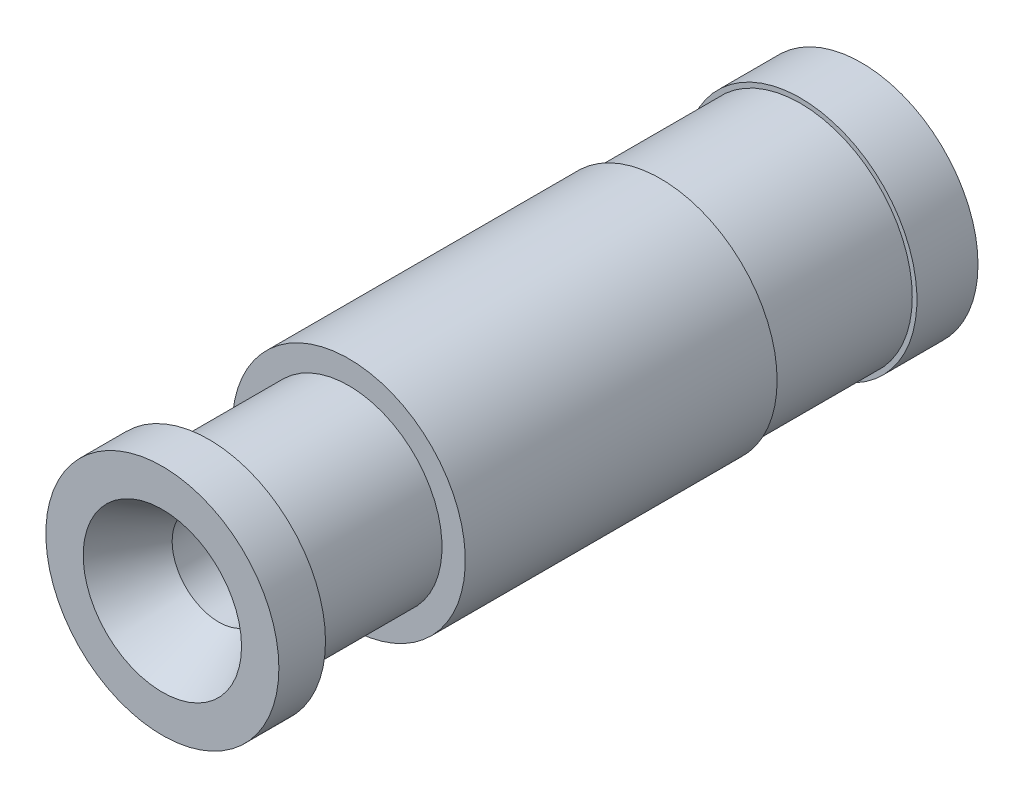
ISO-10303-21;
HEADER;
FILE_DESCRIPTION(('STEP AP214'),'2;1');
FILE_NAME('part.step','',(''),(''),'','','');
FILE_SCHEMA(('AUTOMOTIVE_DESIGN { 1 0 10303 214 1 1 1 1 }'));
ENDSEC;
DATA;
#1=APPLICATION_CONTEXT('core data for automotive mechanical design processes');
#2=APPLICATION_PROTOCOL_DEFINITION('international standard','automotive_design',2000,#1);
#3=PRODUCT_CONTEXT('',#1,'mechanical');
#4=PRODUCT('Part','Part','',(#3));
#5=PRODUCT_RELATED_PRODUCT_CATEGORY('part','',(#4));
#6=PRODUCT_DEFINITION_FORMATION('','',#4);
#7=PRODUCT_DEFINITION_CONTEXT('part definition',#1,'design');
#8=PRODUCT_DEFINITION('design','',#6,#7);
#9=PRODUCT_DEFINITION_SHAPE('','',#8);
#10=(LENGTH_UNIT() NAMED_UNIT(*) SI_UNIT(.MILLI.,.METRE.));
#11=(NAMED_UNIT(*) PLANE_ANGLE_UNIT() SI_UNIT($,.RADIAN.));
#12=(NAMED_UNIT(*) SI_UNIT($,.STERADIAN.) SOLID_ANGLE_UNIT());
#13=UNCERTAINTY_MEASURE_WITH_UNIT(LENGTH_MEASURE(1.E-05),#10,'distance_accuracy_value','');
#14=(GEOMETRIC_REPRESENTATION_CONTEXT(3) GLOBAL_UNCERTAINTY_ASSIGNED_CONTEXT((#13)) GLOBAL_UNIT_ASSIGNED_CONTEXT((#10,
#11,#12)) REPRESENTATION_CONTEXT('',''));
#15=CARTESIAN_POINT('',(0.,0.,0.));
#16=DIRECTION('',(0.,0.,1.));
#17=DIRECTION('',(1.,0.,0.));
#18=AXIS2_PLACEMENT_3D('',#15,#16,#17);
#19=CARTESIAN_POINT('',(0.,0.,15.));
#20=DIRECTION('',(0.,0.,-1.));
#21=DIRECTION('',(-1.,0.,0.));
#22=AXIS2_PLACEMENT_3D('',#19,#20,#21);
#23=CYLINDRICAL_SURFACE('',#22,2.5);
#24=CARTESIAN_POINT('',(0.,0.,4.31010946820187));
#25=DIRECTION('',(0.,0.,1.));
#26=DIRECTION('',(1.,0.,0.));
#27=AXIS2_PLACEMENT_3D('',#24,#25,#26);
#28=CIRCLE('',#27,2.5);
#29=CARTESIAN_POINT('',(2.5,0.,4.31010946820187));
#30=VERTEX_POINT('',#29);
#31=EDGE_CURVE('E57',#30,#30,#28,.T.);
#32=ORIENTED_EDGE('',*,*,#31,.T.);
#33=EDGE_LOOP('',(#32));
#34=FACE_BOUND('',#33,.T.);
#35=CARTESIAN_POINT('',(0.,0.,11.));
#36=DIRECTION('',(0.,0.,-1.));
#37=DIRECTION('',(-1.,0.,0.));
#38=AXIS2_PLACEMENT_3D('',#35,#36,#37);
#39=CIRCLE('',#38,2.5);
#40=CARTESIAN_POINT('',(-2.5,0.,11.));
#41=VERTEX_POINT('',#40);
#42=EDGE_CURVE('E69',#41,#41,#39,.T.);
#43=ORIENTED_EDGE('',*,*,#42,.T.);
#44=EDGE_LOOP('',(#43));
#45=FACE_BOUND('',#44,.T.);
#46=ADVANCED_FACE('F36',(#34,#45),#23,.T.);
#47=CARTESIAN_POINT('',(0.,0.,14.));
#48=DIRECTION('',(0.,0.,1.));
#49=DIRECTION('',(1.,0.,0.));
#50=AXIS2_PLACEMENT_3D('',#47,#48,#49);
#51=CIRCLE('',#50,2.5);
#52=CARTESIAN_POINT('',(2.5,0.,14.));
#53=VERTEX_POINT('',#52);
#54=EDGE_CURVE('E65',#53,#53,#51,.T.);
#55=ORIENTED_EDGE('',*,*,#54,.T.);
#56=EDGE_LOOP('',(#55));
#57=FACE_BOUND('',#56,.T.);
#58=CARTESIAN_POINT('',(0.,0.,15.));
#59=DIRECTION('',(0.,0.,1.));
#60=DIRECTION('',(1.,0.,0.));
#61=AXIS2_PLACEMENT_3D('',#58,#59,#60);
#62=CIRCLE('',#61,2.5);
#63=CARTESIAN_POINT('',(2.5,0.,15.));
#64=VERTEX_POINT('',#63);
#65=EDGE_CURVE('E56',#64,#64,#62,.T.);
#66=ORIENTED_EDGE('',*,*,#65,.F.);
#67=EDGE_LOOP('',(#66));
#68=FACE_BOUND('',#67,.T.);
#69=ADVANCED_FACE('F112',(#57,#68),#23,.T.);
#70=CARTESIAN_POINT('',(0.,0.,1.31010946820187));
#71=DIRECTION('',(0.,0.,-1.));
#72=DIRECTION('',(-1.,0.,0.));
#73=AXIS2_PLACEMENT_3D('',#70,#71,#72);
#74=CIRCLE('',#73,2.5);
#75=CARTESIAN_POINT('',(-2.5,0.,1.31010946820187));
#76=VERTEX_POINT('',#75);
#77=EDGE_CURVE('E61',#76,#76,#74,.T.);
#78=ORIENTED_EDGE('',*,*,#77,.T.);
#79=EDGE_LOOP('',(#78));
#80=FACE_BOUND('',#79,.T.);
#81=CARTESIAN_POINT('',(0.,0.,0.));
#82=DIRECTION('',(0.,0.,1.));
#83=DIRECTION('',(1.,0.,0.));
#84=AXIS2_PLACEMENT_3D('',#81,#82,#83);
#85=CIRCLE('',#84,2.5);
#86=CARTESIAN_POINT('',(2.5,0.,0.));
#87=VERTEX_POINT('',#86);
#88=EDGE_CURVE('E76',#87,#87,#85,.T.);
#89=ORIENTED_EDGE('',*,*,#88,.T.);
#90=EDGE_LOOP('',(#89));
#91=FACE_BOUND('',#90,.T.);
#92=ADVANCED_FACE('F114',(#80,#91),#23,.T.);
#93=CARTESIAN_POINT('',(0.,0.,15.));
#94=DIRECTION('',(0.,0.,1.));
#95=DIRECTION('',(1.,0.,0.));
#96=AXIS2_PLACEMENT_3D('',#93,#94,#95);
#97=PLANE('',#96);
#98=CARTESIAN_POINT('',(0.,0.,15.));
#99=DIRECTION('',(0.,0.,1.));
#100=DIRECTION('',(1.,0.,0.));
#101=AXIS2_PLACEMENT_3D('',#98,#99,#100);
#102=CIRCLE('',#101,1.69859382571945);
#103=CARTESIAN_POINT('',(1.69859382571945,0.,15.));
#104=VERTEX_POINT('',#103);
#105=EDGE_CURVE('E43',#104,#104,#102,.F.);
#106=ORIENTED_EDGE('',*,*,#105,.T.);
#107=EDGE_LOOP('',(#106));
#108=FACE_BOUND('',#107,.T.);
#109=ORIENTED_EDGE('',*,*,#65,.T.);
#110=EDGE_LOOP('',(#109));
#111=FACE_BOUND('',#110,.T.);
#112=ADVANCED_FACE('F143',(#108,#111),#97,.T.);
#113=CARTESIAN_POINT('',(0.,0.,0.));
#114=DIRECTION('',(0.,0.,1.));
#115=DIRECTION('',(1.,0.,0.));
#116=AXIS2_PLACEMENT_3D('',#113,#114,#115);
#117=PLANE('',#116);
#118=CARTESIAN_POINT('',(0.,0.,0.));
#119=DIRECTION('',(0.,0.,1.));
#120=DIRECTION('',(1.,0.,0.));
#121=AXIS2_PLACEMENT_3D('',#118,#119,#120);
#122=CIRCLE('',#121,2.15);
#123=CARTESIAN_POINT('',(2.15,0.,0.));
#124=VERTEX_POINT('',#123);
#125=EDGE_CURVE('E47',#124,#124,#122,.T.);
#126=ORIENTED_EDGE('',*,*,#125,.T.);
#127=EDGE_LOOP('',(#126));
#128=FACE_BOUND('',#127,.T.);
#129=ORIENTED_EDGE('',*,*,#88,.F.);
#130=EDGE_LOOP('',(#129));
#131=FACE_BOUND('',#130,.T.);
#132=ADVANCED_FACE('F142',(#128,#131),#117,.F.);
#133=CARTESIAN_POINT('',(0.,0.,15.));
#134=DIRECTION('',(0.,0.,-1.));
#135=DIRECTION('',(-1.,0.,0.));
#136=AXIS2_PLACEMENT_3D('',#133,#134,#135);
#137=CYLINDRICAL_SURFACE('',#136,1.);
#138=CARTESIAN_POINT('',(0.,0.,13.79));
#139=DIRECTION('',(0.,0.,1.));
#140=DIRECTION('',(1.,0.,0.));
#141=AXIS2_PLACEMENT_3D('',#138,#139,#140);
#142=CIRCLE('',#141,1.);
#143=CARTESIAN_POINT('',(1.,0.,13.79));
#144=VERTEX_POINT('',#143);
#145=EDGE_CURVE('E10',#144,#144,#142,.T.);
#146=ORIENTED_EDGE('',*,*,#145,.T.);
#147=EDGE_LOOP('',(#146));
#148=FACE_BOUND('',#147,.T.);
#149=CARTESIAN_POINT('',(0.,0.,9.39055940236791));
#150=DIRECTION('',(0.,0.,-1.));
#151=DIRECTION('',(-1.,0.,0.));
#152=AXIS2_PLACEMENT_3D('',#149,#150,#151);
#153=CIRCLE('',#152,1.);
#154=CARTESIAN_POINT('',(-1.,0.,9.39055940236791));
#155=VERTEX_POINT('',#154);
#156=EDGE_CURVE('E73',#155,#155,#153,.T.);
#157=ORIENTED_EDGE('',*,*,#156,.T.);
#158=EDGE_LOOP('',(#157));
#159=FACE_BOUND('',#158,.T.);
#160=ADVANCED_FACE('F138',(#148,#159),#137,.F.);
#161=CARTESIAN_POINT('',(0.,0.,9.));
#162=DIRECTION('',(0.,0.,-1.));
#163=DIRECTION('',(-1.,0.,0.));
#164=AXIS2_PLACEMENT_3D('',#161,#162,#163);
#165=CONICAL_SURFACE('',#164,1.65,1.02974425867665);
#166=CARTESIAN_POINT('',(0.,0.,9.));
#167=DIRECTION('',(0.,0.,-1.));
#168=DIRECTION('',(-1.,0.,0.));
#169=AXIS2_PLACEMENT_3D('',#166,#167,#168);
#170=CIRCLE('',#169,1.65);
#171=CARTESIAN_POINT('',(-1.65,0.,9.));
#172=VERTEX_POINT('',#171);
#173=EDGE_CURVE('E68',#172,#172,#170,.T.);
#174=ORIENTED_EDGE('',*,*,#173,.T.);
#175=EDGE_LOOP('',(#174));
#176=FACE_BOUND('',#175,.T.);
#177=ORIENTED_EDGE('',*,*,#156,.F.);
#178=EDGE_LOOP('',(#177));
#179=FACE_BOUND('',#178,.T.);
#180=ADVANCED_FACE('F134',(#176,#179),#165,.F.);
#181=CARTESIAN_POINT('',(0.,0.,0.));
#182=DIRECTION('',(0.,0.,-1.));
#183=DIRECTION('',(-1.,0.,0.));
#184=AXIS2_PLACEMENT_3D('',#181,#182,#183);
#185=CYLINDRICAL_SURFACE('',#184,1.65);
#186=CARTESIAN_POINT('',(0.,0.,0.866025403784435));
#187=DIRECTION('',(0.,0.,1.));
#188=DIRECTION('',(1.,0.,0.));
#189=AXIS2_PLACEMENT_3D('',#186,#187,#188);
#190=CIRCLE('',#189,1.65);
#191=CARTESIAN_POINT('',(1.65,0.,0.866025403784435));
#192=VERTEX_POINT('',#191);
#193=EDGE_CURVE('E51',#192,#192,#190,.F.);
#194=ORIENTED_EDGE('',*,*,#193,.T.);
#195=EDGE_LOOP('',(#194));
#196=FACE_BOUND('',#195,.T.);
#197=ORIENTED_EDGE('',*,*,#173,.F.);
#198=EDGE_LOOP('',(#197));
#199=FACE_BOUND('',#198,.T.);
#200=ADVANCED_FACE('F128',(#196,#199),#185,.F.);
#201=CARTESIAN_POINT('',(0.,-3.79379159500485,14.));
#202=DIRECTION('',(0.,0.,1.));
#203=DIRECTION('',(1.,0.,0.));
#204=AXIS2_PLACEMENT_3D('',#201,#202,#203);
#205=PLANE('',#204);
#206=CARTESIAN_POINT('',(0.,0.,14.));
#207=DIRECTION('',(0.,0.,-1.));
#208=DIRECTION('',(-1.,0.,0.));
#209=AXIS2_PLACEMENT_3D('',#206,#207,#208);
#210=CIRCLE('',#209,2.);
#211=CARTESIAN_POINT('',(-2.,0.,14.));
#212=VERTEX_POINT('',#211);
#213=EDGE_CURVE('E72',#212,#212,#210,.T.);
#214=ORIENTED_EDGE('',*,*,#213,.F.);
#215=EDGE_LOOP('',(#214));
#216=FACE_BOUND('',#215,.T.);
#217=ORIENTED_EDGE('',*,*,#54,.F.);
#218=EDGE_LOOP('',(#217));
#219=FACE_BOUND('',#218,.T.);
#220=ADVANCED_FACE('F119',(#216,#219),#205,.F.);
#221=CARTESIAN_POINT('',(0.,-3.79379159500486,11.));
#222=DIRECTION('',(0.,0.,-1.));
#223=DIRECTION('',(-1.,0.,0.));
#224=AXIS2_PLACEMENT_3D('',#221,#222,#223);
#225=PLANE('',#224);
#226=CARTESIAN_POINT('',(0.,0.,11.));
#227=DIRECTION('',(0.,0.,-1.));
#228=DIRECTION('',(-1.,0.,0.));
#229=AXIS2_PLACEMENT_3D('',#226,#227,#228);
#230=CIRCLE('',#229,2.);
#231=CARTESIAN_POINT('',(-2.,0.,11.));
#232=VERTEX_POINT('',#231);
#233=EDGE_CURVE('E60',#232,#232,#230,.T.);
#234=ORIENTED_EDGE('',*,*,#233,.T.);
#235=EDGE_LOOP('',(#234));
#236=FACE_BOUND('',#235,.T.);
#237=ORIENTED_EDGE('',*,*,#42,.F.);
#238=EDGE_LOOP('',(#237));
#239=FACE_BOUND('',#238,.T.);
#240=ADVANCED_FACE('F117',(#236,#239),#225,.F.);
#241=CARTESIAN_POINT('',(0.,0.,0.));
#242=DIRECTION('',(0.,0.,-1.));
#243=DIRECTION('',(-1.,0.,0.));
#244=AXIS2_PLACEMENT_3D('',#241,#242,#243);
#245=CYLINDRICAL_SURFACE('',#244,2.);
#246=ORIENTED_EDGE('',*,*,#233,.F.);
#247=EDGE_LOOP('',(#246));
#248=FACE_BOUND('',#247,.T.);
#249=ORIENTED_EDGE('',*,*,#213,.T.);
#250=EDGE_LOOP('',(#249));
#251=FACE_BOUND('',#250,.T.);
#252=ADVANCED_FACE('F106',(#248,#251),#245,.T.);
#253=CARTESIAN_POINT('',(0.,-3.9266779236927,4.31010946820187));
#254=DIRECTION('',(0.,0.,1.));
#255=DIRECTION('',(1.,0.,0.));
#256=AXIS2_PLACEMENT_3D('',#253,#254,#255);
#257=PLANE('',#256);
#258=CARTESIAN_POINT('',(0.,0.,4.31010946820187));
#259=DIRECTION('',(0.,0.,-1.));
#260=DIRECTION('',(-1.,0.,0.));
#261=AXIS2_PLACEMENT_3D('',#258,#259,#260);
#262=CIRCLE('',#261,2.4);
#263=CARTESIAN_POINT('',(-2.4,0.,4.31010946820187));
#264=VERTEX_POINT('',#263);
#265=EDGE_CURVE('E64',#264,#264,#262,.T.);
#266=ORIENTED_EDGE('',*,*,#265,.F.);
#267=EDGE_LOOP('',(#266));
#268=FACE_BOUND('',#267,.T.);
#269=ORIENTED_EDGE('',*,*,#31,.F.);
#270=EDGE_LOOP('',(#269));
#271=FACE_BOUND('',#270,.T.);
#272=ADVANCED_FACE('F103',(#268,#271),#257,.F.);
#273=CARTESIAN_POINT('',(0.,-2.4,1.31010946820187));
#274=DIRECTION('',(0.,0.,-1.));
#275=DIRECTION('',(-1.,0.,0.));
#276=AXIS2_PLACEMENT_3D('',#273,#274,#275);
#277=PLANE('',#276);
#278=CARTESIAN_POINT('',(0.,0.,1.31010946820187));
#279=DIRECTION('',(0.,0.,-1.));
#280=DIRECTION('',(-1.,0.,0.));
#281=AXIS2_PLACEMENT_3D('',#278,#279,#280);
#282=CIRCLE('',#281,2.4);
#283=CARTESIAN_POINT('',(-2.4,0.,1.31010946820187));
#284=VERTEX_POINT('',#283);
#285=EDGE_CURVE('E89',#284,#284,#282,.T.);
#286=ORIENTED_EDGE('',*,*,#285,.T.);
#287=EDGE_LOOP('',(#286));
#288=FACE_BOUND('',#287,.T.);
#289=ORIENTED_EDGE('',*,*,#77,.F.);
#290=EDGE_LOOP('',(#289));
#291=FACE_BOUND('',#290,.T.);
#292=ADVANCED_FACE('F93',(#288,#291),#277,.F.);
#293=CARTESIAN_POINT('',(0.,0.,0.));
#294=DIRECTION('',(0.,0.,-1.));
#295=DIRECTION('',(-1.,0.,0.));
#296=AXIS2_PLACEMENT_3D('',#293,#294,#295);
#297=CYLINDRICAL_SURFACE('',#296,2.4);
#298=ORIENTED_EDGE('',*,*,#285,.F.);
#299=EDGE_LOOP('',(#298));
#300=FACE_BOUND('',#299,.T.);
#301=ORIENTED_EDGE('',*,*,#265,.T.);
#302=EDGE_LOOP('',(#301));
#303=FACE_BOUND('',#302,.T.);
#304=ADVANCED_FACE('F96',(#300,#303),#297,.T.);
#305=CARTESIAN_POINT('',(0.,0.,0.866025403784435));
#306=DIRECTION('',(0.,0.,-1.));
#307=DIRECTION('',(-1.,0.,0.));
#308=AXIS2_PLACEMENT_3D('',#305,#306,#307);
#309=CONICAL_SURFACE('',#308,1.65,0.5235987755983);
#310=ORIENTED_EDGE('',*,*,#125,.F.);
#311=EDGE_LOOP('',(#310));
#312=FACE_BOUND('',#311,.T.);
#313=ORIENTED_EDGE('',*,*,#193,.F.);
#314=EDGE_LOOP('',(#313));
#315=FACE_BOUND('',#314,.T.);
#316=ADVANCED_FACE('F99',(#312,#315),#309,.F.);
#317=CARTESIAN_POINT('',(0.,0.,15.));
#318=DIRECTION('',(0.,0.,1.));
#319=DIRECTION('',(1.,0.,0.));
#320=AXIS2_PLACEMENT_3D('',#317,#318,#319);
#321=CONICAL_SURFACE('',#320,1.69859382571945,0.523598775598297);
#322=ORIENTED_EDGE('',*,*,#145,.F.);
#323=EDGE_LOOP('',(#322));
#324=FACE_BOUND('',#323,.T.);
#325=ORIENTED_EDGE('',*,*,#105,.F.);
#326=EDGE_LOOP('',(#325));
#327=FACE_BOUND('',#326,.T.);
#328=ADVANCED_FACE('F38',(#324,#327),#321,.F.);
#329=CLOSED_SHELL('',(#46,#69,#92,#112,#132,#160,#180,#200,#220,#240,#252,#272,#292,#304,#316,#328));
#330=MANIFOLD_SOLID_BREP('B2',#329);
#331=ADVANCED_BREP_SHAPE_REPRESENTATION('',(#18,#330),#14);
#332=SHAPE_DEFINITION_REPRESENTATION(#9,#331);
ENDSEC;
END-ISO-10303-21;
